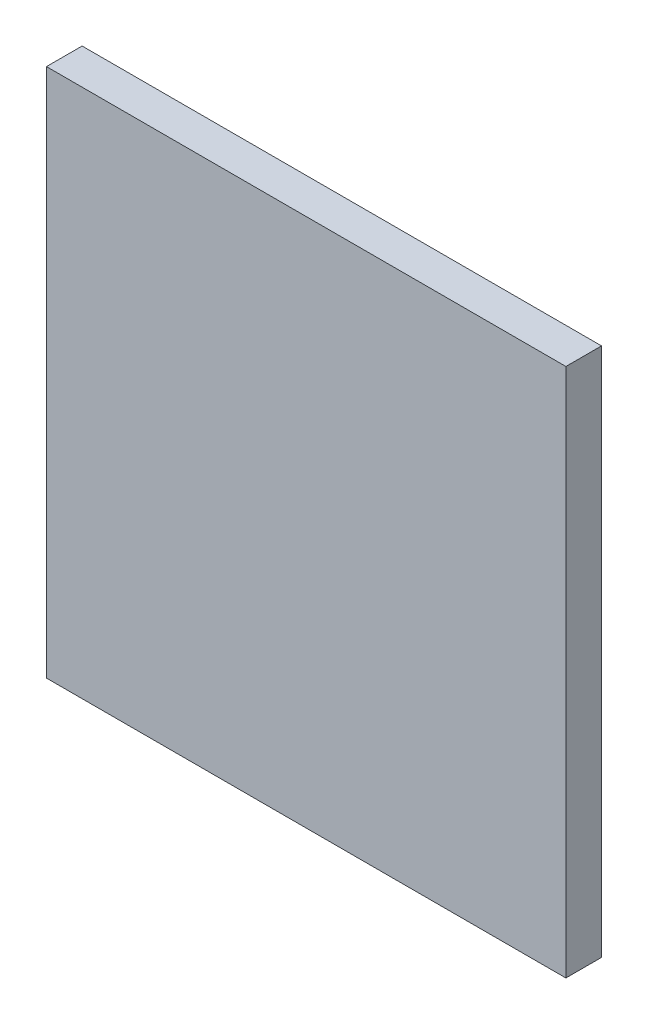
ISO-10303-21;
HEADER;
FILE_DESCRIPTION(('STEP AP214'),'2;1');
FILE_NAME('part.step','',(''),(''),'','','');
FILE_SCHEMA(('AUTOMOTIVE_DESIGN { 1 0 10303 214 1 1 1 1 }'));
ENDSEC;
DATA;
#1=APPLICATION_CONTEXT('core data for automotive mechanical design processes');
#2=APPLICATION_PROTOCOL_DEFINITION('international standard','automotive_design',2000,#1);
#3=PRODUCT_CONTEXT('',#1,'mechanical');
#4=PRODUCT('Part','Part','',(#3));
#5=PRODUCT_RELATED_PRODUCT_CATEGORY('part','',(#4));
#6=PRODUCT_DEFINITION_FORMATION('','',#4);
#7=PRODUCT_DEFINITION_CONTEXT('part definition',#1,'design');
#8=PRODUCT_DEFINITION('design','',#6,#7);
#9=PRODUCT_DEFINITION_SHAPE('','',#8);
#10=(LENGTH_UNIT() NAMED_UNIT(*) SI_UNIT(.MILLI.,.METRE.));
#11=(NAMED_UNIT(*) PLANE_ANGLE_UNIT() SI_UNIT($,.RADIAN.));
#12=(NAMED_UNIT(*) SI_UNIT($,.STERADIAN.) SOLID_ANGLE_UNIT());
#13=UNCERTAINTY_MEASURE_WITH_UNIT(LENGTH_MEASURE(1.E-05),#10,'distance_accuracy_value','');
#14=(GEOMETRIC_REPRESENTATION_CONTEXT(3) GLOBAL_UNCERTAINTY_ASSIGNED_CONTEXT((#13)) GLOBAL_UNIT_ASSIGNED_CONTEXT((#10,
#11,#12)) REPRESENTATION_CONTEXT('',''));
#15=CARTESIAN_POINT('',(0.,0.,0.));
#16=DIRECTION('',(0.,0.,1.));
#17=DIRECTION('',(1.,0.,0.));
#18=AXIS2_PLACEMENT_3D('',#15,#16,#17);
#19=CARTESIAN_POINT('',(1.5,0.7,0.38));
#20=DIRECTION('',(0.,0.,1.));
#21=DIRECTION('',(1.,0.,0.));
#22=AXIS2_PLACEMENT_3D('',#19,#20,#21);
#23=PLANE('',#22);
#24=DIRECTION('',(0.,1.,0.));
#25=VECTOR('',#24,1.);
#26=CARTESIAN_POINT('',(6.6,0.7,0.38));
#27=LINE('',#26,#25);
#28=CARTESIAN_POINT('',(6.6,5.9,0.38));
#29=VERTEX_POINT('',#28);
#30=CARTESIAN_POINT('',(6.6,0.7,0.38));
#31=VERTEX_POINT('',#30);
#32=EDGE_CURVE('E82',#29,#31,#27,.F.);
#33=ORIENTED_EDGE('',*,*,#32,.F.);
#34=DIRECTION('',(1.,0.,0.));
#35=VECTOR('',#34,1.);
#36=CARTESIAN_POINT('',(1.5,5.9,0.38));
#37=LINE('',#36,#35);
#38=CARTESIAN_POINT('',(1.5,5.9,0.38));
#39=VERTEX_POINT('',#38);
#40=EDGE_CURVE('E58',#39,#29,#37,.T.);
#41=ORIENTED_EDGE('',*,*,#40,.F.);
#42=DIRECTION('',(0.,1.,0.));
#43=VECTOR('',#42,1.);
#44=CARTESIAN_POINT('',(1.5,0.7,0.38));
#45=LINE('',#44,#43);
#46=CARTESIAN_POINT('',(1.5,0.7,0.38));
#47=VERTEX_POINT('',#46);
#48=EDGE_CURVE('E19',#39,#47,#45,.F.);
#49=ORIENTED_EDGE('',*,*,#48,.T.);
#50=DIRECTION('',(1.,0.,0.));
#51=VECTOR('',#50,1.);
#52=CARTESIAN_POINT('',(1.5,0.7,0.38));
#53=LINE('',#52,#51);
#54=EDGE_CURVE('E55',#47,#31,#53,.T.);
#55=ORIENTED_EDGE('',*,*,#54,.T.);
#56=EDGE_LOOP('',(#33,#41,#49,#55));
#57=FACE_BOUND('',#56,.T.);
#58=ADVANCED_FACE('F16',(#57),#23,.T.);
#59=CARTESIAN_POINT('',(1.5,0.7,0.03));
#60=DIRECTION('',(1.,0.,0.));
#61=DIRECTION('',(0.,0.,-1.));
#62=AXIS2_PLACEMENT_3D('',#59,#60,#61);
#63=PLANE('',#62);
#64=DIRECTION('',(0.,0.,1.));
#65=VECTOR('',#64,1.);
#66=CARTESIAN_POINT('',(1.5,5.9,0.03));
#67=LINE('',#66,#65);
#68=CARTESIAN_POINT('',(1.5,5.9,0.03));
#69=VERTEX_POINT('',#68);
#70=EDGE_CURVE('E84',#69,#39,#67,.T.);
#71=ORIENTED_EDGE('',*,*,#70,.F.);
#72=DIRECTION('',(0.,1.,0.));
#73=VECTOR('',#72,1.);
#74=CARTESIAN_POINT('',(1.5,0.7,0.03));
#75=LINE('',#74,#73);
#76=CARTESIAN_POINT('',(1.5,0.7,0.03));
#77=VERTEX_POINT('',#76);
#78=EDGE_CURVE('E75',#69,#77,#75,.F.);
#79=ORIENTED_EDGE('',*,*,#78,.T.);
#80=DIRECTION('',(0.,0.,1.));
#81=VECTOR('',#80,1.);
#82=CARTESIAN_POINT('',(1.5,0.7,0.03));
#83=LINE('',#82,#81);
#84=EDGE_CURVE('E64',#77,#47,#83,.T.);
#85=ORIENTED_EDGE('',*,*,#84,.T.);
#86=ORIENTED_EDGE('',*,*,#48,.F.);
#87=EDGE_LOOP('',(#71,#79,#85,#86));
#88=FACE_BOUND('',#87,.T.);
#89=ADVANCED_FACE('F74',(#88),#63,.F.);
#90=CARTESIAN_POINT('',(1.5,0.7,0.03));
#91=DIRECTION('',(0.,1.,0.));
#92=DIRECTION('',(0.,0.,1.));
#93=AXIS2_PLACEMENT_3D('',#90,#91,#92);
#94=PLANE('',#93);
#95=ORIENTED_EDGE('',*,*,#54,.F.);
#96=ORIENTED_EDGE('',*,*,#84,.F.);
#97=DIRECTION('',(1.,0.,0.));
#98=VECTOR('',#97,1.);
#99=CARTESIAN_POINT('',(1.5,0.7,0.03));
#100=LINE('',#99,#98);
#101=CARTESIAN_POINT('',(6.6,0.7,0.03));
#102=VERTEX_POINT('',#101);
#103=EDGE_CURVE('E93',#77,#102,#100,.T.);
#104=ORIENTED_EDGE('',*,*,#103,.T.);
#105=DIRECTION('',(0.,0.,-1.));
#106=VECTOR('',#105,1.);
#107=CARTESIAN_POINT('',(6.6,0.7,0.03));
#108=LINE('',#107,#106);
#109=EDGE_CURVE('E70',#31,#102,#108,.T.);
#110=ORIENTED_EDGE('',*,*,#109,.F.);
#111=EDGE_LOOP('',(#95,#96,#104,#110));
#112=FACE_BOUND('',#111,.T.);
#113=ADVANCED_FACE('F67',(#112),#94,.F.);
#114=CARTESIAN_POINT('',(6.6,0.7,0.03));
#115=DIRECTION('',(1.,0.,0.));
#116=DIRECTION('',(0.,0.,-1.));
#117=AXIS2_PLACEMENT_3D('',#114,#115,#116);
#118=PLANE('',#117);
#119=DIRECTION('',(0.,0.,1.));
#120=VECTOR('',#119,1.);
#121=CARTESIAN_POINT('',(6.6,5.9,0.03));
#122=LINE('',#121,#120);
#123=CARTESIAN_POINT('',(6.6,5.9,0.03));
#124=VERTEX_POINT('',#123);
#125=EDGE_CURVE('E34',#29,#124,#122,.F.);
#126=ORIENTED_EDGE('',*,*,#125,.F.);
#127=ORIENTED_EDGE('',*,*,#32,.T.);
#128=ORIENTED_EDGE('',*,*,#109,.T.);
#129=DIRECTION('',(0.,1.,0.));
#130=VECTOR('',#129,1.);
#131=CARTESIAN_POINT('',(6.6,0.7,0.03));
#132=LINE('',#131,#130);
#133=EDGE_CURVE('E26',#102,#124,#132,.T.);
#134=ORIENTED_EDGE('',*,*,#133,.T.);
#135=EDGE_LOOP('',(#126,#127,#128,#134));
#136=FACE_BOUND('',#135,.T.);
#137=ADVANCED_FACE('F100',(#136),#118,.T.);
#138=CARTESIAN_POINT('',(1.5,5.9,0.03));
#139=DIRECTION('',(0.,1.,0.));
#140=DIRECTION('',(0.,0.,1.));
#141=AXIS2_PLACEMENT_3D('',#138,#139,#140);
#142=PLANE('',#141);
#143=ORIENTED_EDGE('',*,*,#40,.T.);
#144=ORIENTED_EDGE('',*,*,#125,.T.);
#145=DIRECTION('',(1.,0.,0.));
#146=VECTOR('',#145,1.);
#147=CARTESIAN_POINT('',(1.5,5.9,0.03));
#148=LINE('',#147,#146);
#149=EDGE_CURVE('E11',#124,#69,#148,.F.);
#150=ORIENTED_EDGE('',*,*,#149,.T.);
#151=ORIENTED_EDGE('',*,*,#70,.T.);
#152=EDGE_LOOP('',(#143,#144,#150,#151));
#153=FACE_BOUND('',#152,.T.);
#154=ADVANCED_FACE('F103',(#153),#142,.T.);
#155=CARTESIAN_POINT('',(1.5,0.7,0.03));
#156=DIRECTION('',(0.,0.,1.));
#157=DIRECTION('',(1.,0.,0.));
#158=AXIS2_PLACEMENT_3D('',#155,#156,#157);
#159=PLANE('',#158);
#160=ORIENTED_EDGE('',*,*,#133,.F.);
#161=ORIENTED_EDGE('',*,*,#103,.F.);
#162=ORIENTED_EDGE('',*,*,#78,.F.);
#163=ORIENTED_EDGE('',*,*,#149,.F.);
#164=EDGE_LOOP('',(#160,#161,#162,#163));
#165=FACE_BOUND('',#164,.T.);
#166=ADVANCED_FACE('F102',(#165),#159,.F.);
#167=CLOSED_SHELL('',(#58,#89,#113,#137,#154,#166));
#168=MANIFOLD_SOLID_BREP('B1',#167);
#169=ADVANCED_BREP_SHAPE_REPRESENTATION('',(#18,#168),#14);
#170=SHAPE_DEFINITION_REPRESENTATION(#9,#169);
ENDSEC;
END-ISO-10303-21;
